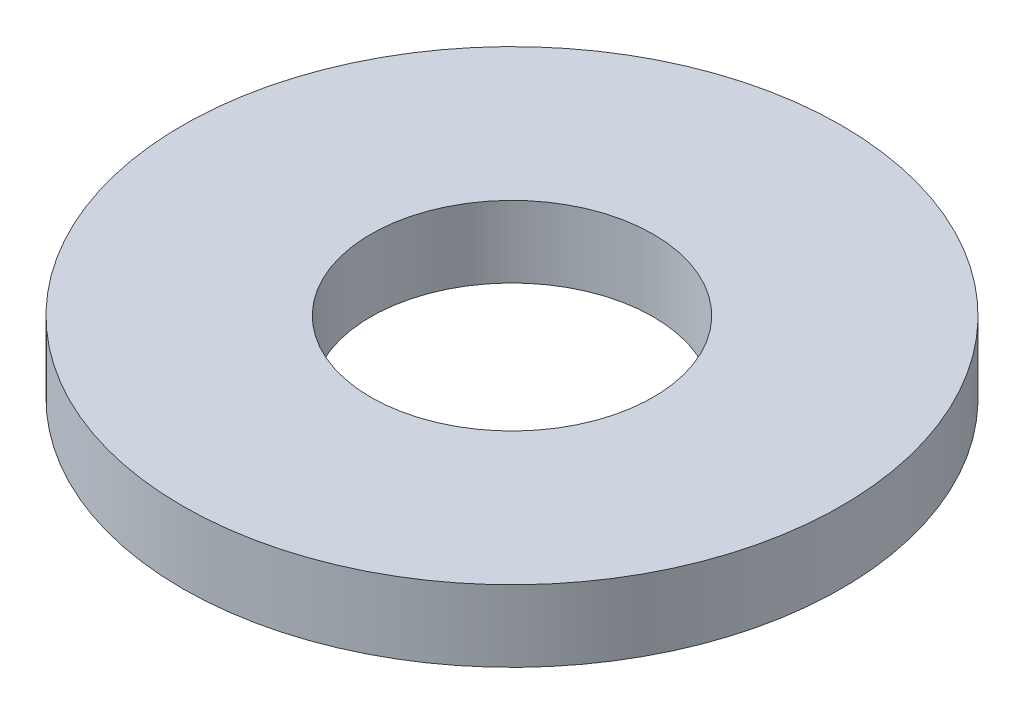
ISO-10303-21;
HEADER;
FILE_DESCRIPTION(('STEP AP214'),'2;1');
FILE_NAME('part.step','',(''),(''),'','','');
FILE_SCHEMA(('AUTOMOTIVE_DESIGN { 1 0 10303 214 1 1 1 1 }'));
ENDSEC;
DATA;
#1=APPLICATION_CONTEXT('core data for automotive mechanical design processes');
#2=APPLICATION_PROTOCOL_DEFINITION('international standard','automotive_design',2000,#1);
#3=PRODUCT_CONTEXT('',#1,'mechanical');
#4=PRODUCT('Part','Part','',(#3));
#5=PRODUCT_RELATED_PRODUCT_CATEGORY('part','',(#4));
#6=PRODUCT_DEFINITION_FORMATION('','',#4);
#7=PRODUCT_DEFINITION_CONTEXT('part definition',#1,'design');
#8=PRODUCT_DEFINITION('design','',#6,#7);
#9=PRODUCT_DEFINITION_SHAPE('','',#8);
#10=(LENGTH_UNIT() NAMED_UNIT(*) SI_UNIT(.MILLI.,.METRE.));
#11=(NAMED_UNIT(*) PLANE_ANGLE_UNIT() SI_UNIT($,.RADIAN.));
#12=(NAMED_UNIT(*) SI_UNIT($,.STERADIAN.) SOLID_ANGLE_UNIT());
#13=UNCERTAINTY_MEASURE_WITH_UNIT(LENGTH_MEASURE(1.E-05),#10,'distance_accuracy_value','');
#14=(GEOMETRIC_REPRESENTATION_CONTEXT(3) GLOBAL_UNCERTAINTY_ASSIGNED_CONTEXT((#13)) GLOBAL_UNIT_ASSIGNED_CONTEXT((#10,
#11,#12)) REPRESENTATION_CONTEXT('',''));
#15=CARTESIAN_POINT('',(0.,0.,0.));
#16=DIRECTION('',(0.,0.,1.));
#17=DIRECTION('',(1.,0.,0.));
#18=AXIS2_PLACEMENT_3D('',#15,#16,#17);
#19=CARTESIAN_POINT('',(0.,19.,0.));
#20=DIRECTION('',(0.,-1.,0.));
#21=DIRECTION('',(0.,0.,-1.));
#22=AXIS2_PLACEMENT_3D('',#19,#20,#21);
#23=CYLINDRICAL_SURFACE('',#22,87.5);
#24=CARTESIAN_POINT('',(0.,19.,0.));
#25=DIRECTION('',(0.,1.,0.));
#26=DIRECTION('',(0.,0.,1.));
#27=AXIS2_PLACEMENT_3D('',#24,#25,#26);
#28=CIRCLE('',#27,87.5);
#29=CARTESIAN_POINT('',(0.,19.,87.5));
#30=VERTEX_POINT('',#29);
#31=EDGE_CURVE('E10',#30,#30,#28,.T.);
#32=ORIENTED_EDGE('',*,*,#31,.F.);
#33=EDGE_LOOP('',(#32));
#34=FACE_BOUND('',#33,.T.);
#35=CARTESIAN_POINT('',(0.,0.,0.));
#36=DIRECTION('',(0.,1.,0.));
#37=DIRECTION('',(0.,0.,1.));
#38=AXIS2_PLACEMENT_3D('',#35,#36,#37);
#39=CIRCLE('',#38,87.5);
#40=CARTESIAN_POINT('',(0.,0.,87.5));
#41=VERTEX_POINT('',#40);
#42=EDGE_CURVE('E37',#41,#41,#39,.T.);
#43=ORIENTED_EDGE('',*,*,#42,.T.);
#44=EDGE_LOOP('',(#43));
#45=FACE_BOUND('',#44,.T.);
#46=ADVANCED_FACE('F40',(#34,#45),#23,.T.);
#47=CARTESIAN_POINT('',(0.,19.,0.));
#48=DIRECTION('',(0.,1.,0.));
#49=DIRECTION('',(0.,0.,1.));
#50=AXIS2_PLACEMENT_3D('',#47,#48,#49);
#51=PLANE('',#50);
#52=CARTESIAN_POINT('',(0.,19.,0.));
#53=DIRECTION('',(0.,1.,0.));
#54=DIRECTION('',(0.,0.,1.));
#55=AXIS2_PLACEMENT_3D('',#52,#53,#54);
#56=CIRCLE('',#55,37.5);
#57=CARTESIAN_POINT('',(0.,19.,37.5));
#58=VERTEX_POINT('',#57);
#59=EDGE_CURVE('E50',#58,#58,#56,.T.);
#60=ORIENTED_EDGE('',*,*,#59,.F.);
#61=EDGE_LOOP('',(#60));
#62=FACE_BOUND('',#61,.T.);
#63=ORIENTED_EDGE('',*,*,#31,.T.);
#64=EDGE_LOOP('',(#63));
#65=FACE_BOUND('',#64,.T.);
#66=ADVANCED_FACE('F59',(#62,#65),#51,.T.);
#67=CARTESIAN_POINT('',(0.,0.,0.));
#68=DIRECTION('',(0.,1.,0.));
#69=DIRECTION('',(0.,0.,1.));
#70=AXIS2_PLACEMENT_3D('',#67,#68,#69);
#71=PLANE('',#70);
#72=CARTESIAN_POINT('',(0.,0.,0.));
#73=DIRECTION('',(0.,1.,0.));
#74=DIRECTION('',(0.,0.,1.));
#75=AXIS2_PLACEMENT_3D('',#72,#73,#74);
#76=CIRCLE('',#75,37.5);
#77=CARTESIAN_POINT('',(0.,0.,37.5));
#78=VERTEX_POINT('',#77);
#79=EDGE_CURVE('E47',#78,#78,#76,.T.);
#80=ORIENTED_EDGE('',*,*,#79,.T.);
#81=EDGE_LOOP('',(#80));
#82=FACE_BOUND('',#81,.T.);
#83=ORIENTED_EDGE('',*,*,#42,.F.);
#84=EDGE_LOOP('',(#83));
#85=FACE_BOUND('',#84,.T.);
#86=ADVANCED_FACE('F58',(#82,#85),#71,.F.);
#87=CARTESIAN_POINT('',(0.,19.,0.));
#88=DIRECTION('',(0.,-1.,0.));
#89=DIRECTION('',(0.,0.,-1.));
#90=AXIS2_PLACEMENT_3D('',#87,#88,#89);
#91=CYLINDRICAL_SURFACE('',#90,37.5);
#92=ORIENTED_EDGE('',*,*,#59,.T.);
#93=EDGE_LOOP('',(#92));
#94=FACE_BOUND('',#93,.T.);
#95=ORIENTED_EDGE('',*,*,#79,.F.);
#96=EDGE_LOOP('',(#95));
#97=FACE_BOUND('',#96,.T.);
#98=ADVANCED_FACE('F54',(#94,#97),#91,.F.);
#99=CLOSED_SHELL('',(#46,#66,#86,#98));
#100=MANIFOLD_SOLID_BREP('B2',#99);
#101=ADVANCED_BREP_SHAPE_REPRESENTATION('',(#18,#100),#14);
#102=SHAPE_DEFINITION_REPRESENTATION(#9,#101);
ENDSEC;
END-ISO-10303-21;
